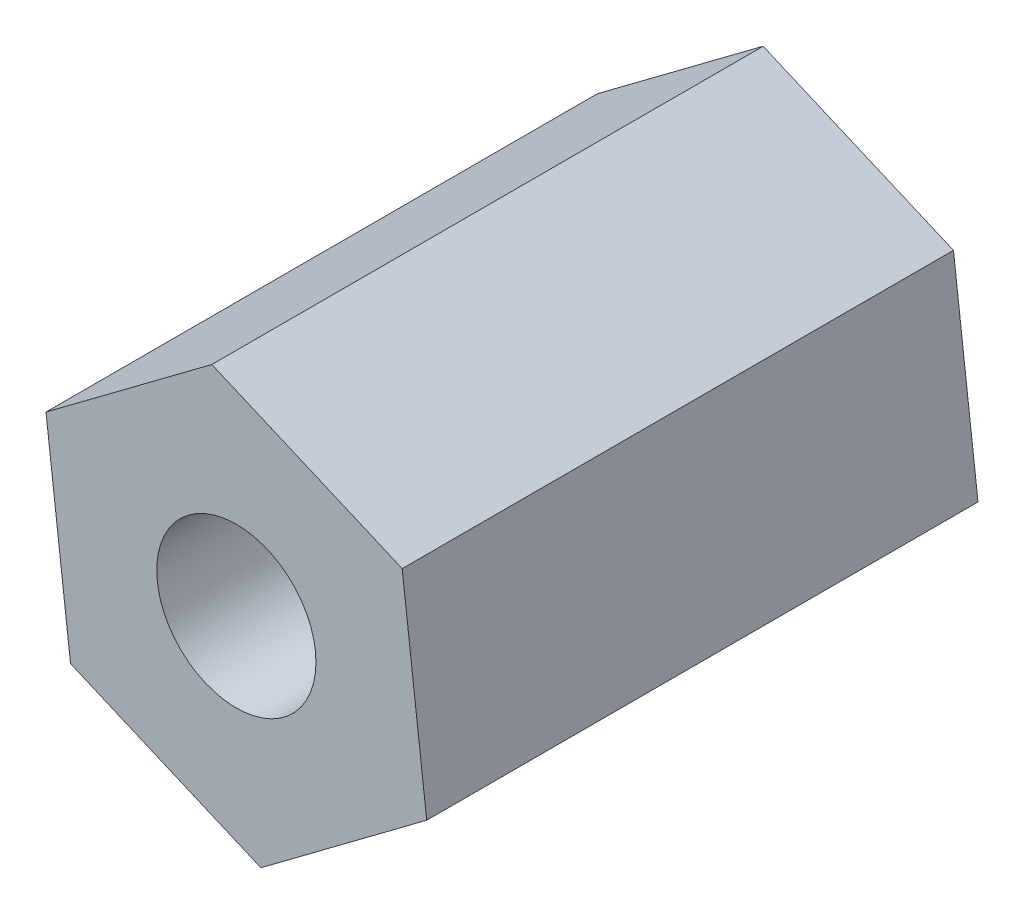
ISO-10303-21;
HEADER;
FILE_DESCRIPTION(('STEP AP214'),'2;1');
FILE_NAME('part.step','',(''),(''),'','','');
FILE_SCHEMA(('AUTOMOTIVE_DESIGN { 1 0 10303 214 1 1 1 1 }'));
ENDSEC;
DATA;
#1=APPLICATION_CONTEXT('core data for automotive mechanical design processes');
#2=APPLICATION_PROTOCOL_DEFINITION('international standard','automotive_design',2000,#1);
#3=PRODUCT_CONTEXT('',#1,'mechanical');
#4=PRODUCT('Part','Part','',(#3));
#5=PRODUCT_RELATED_PRODUCT_CATEGORY('part','',(#4));
#6=PRODUCT_DEFINITION_FORMATION('','',#4);
#7=PRODUCT_DEFINITION_CONTEXT('part definition',#1,'design');
#8=PRODUCT_DEFINITION('design','',#6,#7);
#9=PRODUCT_DEFINITION_SHAPE('','',#8);
#10=(LENGTH_UNIT() NAMED_UNIT(*) SI_UNIT(.MILLI.,.METRE.));
#11=(NAMED_UNIT(*) PLANE_ANGLE_UNIT() SI_UNIT($,.RADIAN.));
#12=(NAMED_UNIT(*) SI_UNIT($,.STERADIAN.) SOLID_ANGLE_UNIT());
#13=UNCERTAINTY_MEASURE_WITH_UNIT(LENGTH_MEASURE(1.E-05),#10,'distance_accuracy_value','');
#14=(GEOMETRIC_REPRESENTATION_CONTEXT(3) GLOBAL_UNCERTAINTY_ASSIGNED_CONTEXT((#13)) GLOBAL_UNIT_ASSIGNED_CONTEXT((#10,
#11,#12)) REPRESENTATION_CONTEXT('',''));
#15=CARTESIAN_POINT('',(0.,0.,0.));
#16=DIRECTION('',(0.,0.,1.));
#17=DIRECTION('',(1.,0.,0.));
#18=AXIS2_PLACEMENT_3D('',#15,#16,#17);
#19=CARTESIAN_POINT('',(-76.4397626249095,4.73853474268454,4.7498));
#20=DIRECTION('',(0.,0.,1.));
#21=DIRECTION('',(1.,0.,0.));
#22=AXIS2_PLACEMENT_3D('',#19,#20,#21);
#23=PLANE('',#22);
#24=DIRECTION('',(0.80071663461952,0.599043296468285,0.));
#25=VECTOR('',#24,1.);
#26=CARTESIAN_POINT('',(-79.2972800788762,2.60072893057818,4.7498));
#27=LINE('',#26,#25);
#28=CARTESIAN_POINT('',(-79.2972800788762,2.60072893057818,4.7498));
#29=VERTEX_POINT('',#28);
#30=CARTESIAN_POINT('',(-76.4397626249095,4.73853474268454,4.7498));
#31=VERTEX_POINT('',#30);
#32=EDGE_CURVE('E131',#29,#31,#27,.T.);
#33=ORIENTED_EDGE('',*,*,#32,.T.);
#34=DIRECTION('',(-0.118428395398547,0.992962595047429,0.));
#35=VECTOR('',#34,1.);
#36=CARTESIAN_POINT('',(-76.4397626249095,4.73853474268454,4.7498));
#37=LINE('',#36,#35);
#38=CARTESIAN_POINT('',(-76.8623980395683,8.28212035563032,4.7498));
#39=VERTEX_POINT('',#38);
#40=EDGE_CURVE('E89',#31,#39,#37,.T.);
#41=ORIENTED_EDGE('',*,*,#40,.T.);
#42=DIRECTION('',(-0.919145030018067,0.393919298579146,0.));
#43=VECTOR('',#42,1.);
#44=CARTESIAN_POINT('',(-76.8623980395683,8.28212035563032,4.7498));
#45=LINE('',#44,#43);
#46=CARTESIAN_POINT('',(-80.1425509081938,9.6879001564697,4.7498));
#47=VERTEX_POINT('',#46);
#48=EDGE_CURVE('E102',#39,#47,#45,.T.);
#49=ORIENTED_EDGE('',*,*,#48,.T.);
#50=DIRECTION('',(-0.800716634619521,-0.599043296468283,0.));
#51=VECTOR('',#50,1.);
#52=CARTESIAN_POINT('',(-80.1425509081938,9.6879001564697,4.7498));
#53=LINE('',#52,#51);
#54=CARTESIAN_POINT('',(-83.0000683621605,7.55009434436333,4.7498));
#55=VERTEX_POINT('',#54);
#56=EDGE_CURVE('E96',#47,#55,#53,.T.);
#57=ORIENTED_EDGE('',*,*,#56,.T.);
#58=DIRECTION('',(0.118428395398548,-0.992962595047429,0.));
#59=VECTOR('',#58,1.);
#60=CARTESIAN_POINT('',(-83.0000683621605,7.55009434436333,4.7498));
#61=LINE('',#60,#59);
#62=CARTESIAN_POINT('',(-82.5774329475017,4.00650873141756,4.7498));
#63=VERTEX_POINT('',#62);
#64=EDGE_CURVE('E100',#55,#63,#61,.T.);
#65=ORIENTED_EDGE('',*,*,#64,.T.);
#66=DIRECTION('',(0.919145030018067,-0.393919298579145,0.));
#67=VECTOR('',#66,1.);
#68=CARTESIAN_POINT('',(-82.5774329475017,4.00650873141756,4.7498));
#69=LINE('',#68,#67);
#70=EDGE_CURVE('E52',#63,#29,#69,.T.);
#71=ORIENTED_EDGE('',*,*,#70,.T.);
#72=EDGE_LOOP('',(#33,#41,#49,#57,#65,#71));
#73=FACE_BOUND('',#72,.T.);
#74=CARTESIAN_POINT('',(-79.719915493535,6.14431454352392,4.7498));
#75=DIRECTION('',(0.,0.,1.));
#76=DIRECTION('',(1.,0.,0.));
#77=AXIS2_PLACEMENT_3D('',#74,#75,#76);
#78=CIRCLE('',#77,1.3716);
#79=CARTESIAN_POINT('',(-78.348315493535,6.14431454352392,4.7498));
#80=VERTEX_POINT('',#79);
#81=EDGE_CURVE('E124',#80,#80,#78,.T.);
#82=ORIENTED_EDGE('',*,*,#81,.F.);
#83=EDGE_LOOP('',(#82));
#84=FACE_BOUND('',#83,.T.);
#85=ADVANCED_FACE('F35',(#73,#84),#23,.T.);
#86=CARTESIAN_POINT('',(-76.4397626249095,4.73853474268454,-4.7498));
#87=DIRECTION('',(0.,0.,1.));
#88=DIRECTION('',(1.,0.,0.));
#89=AXIS2_PLACEMENT_3D('',#86,#87,#88);
#90=PLANE('',#89);
#91=DIRECTION('',(0.80071663461952,0.599043296468285,0.));
#92=VECTOR('',#91,1.);
#93=CARTESIAN_POINT('',(-79.2972800788762,2.60072893057818,-4.7498));
#94=LINE('',#93,#92);
#95=CARTESIAN_POINT('',(-79.2972800788762,2.60072893057818,-4.7498));
#96=VERTEX_POINT('',#95);
#97=CARTESIAN_POINT('',(-76.4397626249095,4.73853474268454,-4.7498));
#98=VERTEX_POINT('',#97);
#99=EDGE_CURVE('E120',#96,#98,#94,.T.);
#100=ORIENTED_EDGE('',*,*,#99,.F.);
#101=DIRECTION('',(0.919145030018067,-0.393919298579145,0.));
#102=VECTOR('',#101,1.);
#103=CARTESIAN_POINT('',(-82.5774329475017,4.00650873141756,-4.7498));
#104=LINE('',#103,#102);
#105=CARTESIAN_POINT('',(-82.5774329475017,4.00650873141756,-4.7498));
#106=VERTEX_POINT('',#105);
#107=EDGE_CURVE('E81',#106,#96,#104,.T.);
#108=ORIENTED_EDGE('',*,*,#107,.F.);
#109=DIRECTION('',(0.118428395398548,-0.992962595047429,0.));
#110=VECTOR('',#109,1.);
#111=CARTESIAN_POINT('',(-83.0000683621605,7.55009434436333,-4.7498));
#112=LINE('',#111,#110);
#113=CARTESIAN_POINT('',(-83.0000683621605,7.55009434436333,-4.7498));
#114=VERTEX_POINT('',#113);
#115=EDGE_CURVE('E75',#114,#106,#112,.T.);
#116=ORIENTED_EDGE('',*,*,#115,.F.);
#117=DIRECTION('',(-0.800716634619521,-0.599043296468283,0.));
#118=VECTOR('',#117,1.);
#119=CARTESIAN_POINT('',(-80.1425509081938,9.6879001564697,-4.7498));
#120=LINE('',#119,#118);
#121=CARTESIAN_POINT('',(-80.1425509081938,9.6879001564697,-4.7498));
#122=VERTEX_POINT('',#121);
#123=EDGE_CURVE('E110',#122,#114,#120,.T.);
#124=ORIENTED_EDGE('',*,*,#123,.F.);
#125=DIRECTION('',(-0.919145030018067,0.393919298579146,0.));
#126=VECTOR('',#125,1.);
#127=CARTESIAN_POINT('',(-76.8623980395683,8.28212035563032,-4.7498));
#128=LINE('',#127,#126);
#129=CARTESIAN_POINT('',(-76.8623980395683,8.28212035563032,-4.7498));
#130=VERTEX_POINT('',#129);
#131=EDGE_CURVE('E126',#130,#122,#128,.T.);
#132=ORIENTED_EDGE('',*,*,#131,.F.);
#133=DIRECTION('',(-0.118428395398547,0.992962595047429,0.));
#134=VECTOR('',#133,1.);
#135=CARTESIAN_POINT('',(-76.4397626249095,4.73853474268454,-4.7498));
#136=LINE('',#135,#134);
#137=EDGE_CURVE('E123',#98,#130,#136,.T.);
#138=ORIENTED_EDGE('',*,*,#137,.F.);
#139=EDGE_LOOP('',(#100,#108,#116,#124,#132,#138));
#140=FACE_BOUND('',#139,.T.);
#141=CARTESIAN_POINT('',(-79.719915493535,6.14431454352392,-4.7498));
#142=DIRECTION('',(0.,0.,1.));
#143=DIRECTION('',(1.,0.,0.));
#144=AXIS2_PLACEMENT_3D('',#141,#142,#143);
#145=CIRCLE('',#144,1.3716);
#146=CARTESIAN_POINT('',(-78.348315493535,6.14431454352392,-4.7498));
#147=VERTEX_POINT('',#146);
#148=EDGE_CURVE('E224',#147,#147,#145,.T.);
#149=ORIENTED_EDGE('',*,*,#148,.T.);
#150=EDGE_LOOP('',(#149));
#151=FACE_BOUND('',#150,.T.);
#152=ADVANCED_FACE('F140',(#140,#151),#90,.F.);
#153=CARTESIAN_POINT('',(-79.2972800788762,2.60072893057818,4.7498));
#154=DIRECTION('',(-0.599043296468285,0.80071663461952,0.));
#155=DIRECTION('',(-0.80071663461952,-0.599043296468285,0.));
#156=AXIS2_PLACEMENT_3D('',#153,#154,#155);
#157=PLANE('',#156);
#158=ORIENTED_EDGE('',*,*,#99,.T.);
#159=DIRECTION('',(0.,0.,-1.));
#160=VECTOR('',#159,1.);
#161=CARTESIAN_POINT('',(-76.4397626249095,4.73853474268454,4.7498));
#162=LINE('',#161,#160);
#163=EDGE_CURVE('E11',#31,#98,#162,.T.);
#164=ORIENTED_EDGE('',*,*,#163,.F.);
#165=ORIENTED_EDGE('',*,*,#32,.F.);
#166=DIRECTION('',(0.,0.,-1.));
#167=VECTOR('',#166,1.);
#168=CARTESIAN_POINT('',(-79.2972800788762,2.60072893057818,4.7498));
#169=LINE('',#168,#167);
#170=EDGE_CURVE('E116',#29,#96,#169,.T.);
#171=ORIENTED_EDGE('',*,*,#170,.T.);
#172=EDGE_LOOP('',(#158,#164,#165,#171));
#173=FACE_BOUND('',#172,.T.);
#174=ADVANCED_FACE('F37',(#173),#157,.F.);
#175=CARTESIAN_POINT('',(-76.4397626249095,4.73853474268454,4.7498));
#176=DIRECTION('',(-0.992962595047429,-0.118428395398547,0.));
#177=DIRECTION('',(0.118428395398547,-0.992962595047429,0.));
#178=AXIS2_PLACEMENT_3D('',#175,#176,#177);
#179=PLANE('',#178);
#180=ORIENTED_EDGE('',*,*,#137,.T.);
#181=DIRECTION('',(0.,0.,-1.));
#182=VECTOR('',#181,1.);
#183=CARTESIAN_POINT('',(-76.8623980395683,8.28212035563032,4.7498));
#184=LINE('',#183,#182);
#185=EDGE_CURVE('E44',#39,#130,#184,.T.);
#186=ORIENTED_EDGE('',*,*,#185,.F.);
#187=ORIENTED_EDGE('',*,*,#40,.F.);
#188=ORIENTED_EDGE('',*,*,#163,.T.);
#189=EDGE_LOOP('',(#180,#186,#187,#188));
#190=FACE_BOUND('',#189,.T.);
#191=ADVANCED_FACE('F165',(#190),#179,.F.);
#192=CARTESIAN_POINT('',(-76.8623980395683,8.28212035563032,4.7498));
#193=DIRECTION('',(-0.393919298579146,-0.919145030018067,0.));
#194=DIRECTION('',(0.919145030018067,-0.393919298579146,0.));
#195=AXIS2_PLACEMENT_3D('',#192,#193,#194);
#196=PLANE('',#195);
#197=ORIENTED_EDGE('',*,*,#131,.T.);
#198=DIRECTION('',(0.,0.,-1.));
#199=VECTOR('',#198,1.);
#200=CARTESIAN_POINT('',(-80.1425509081938,9.6879001564697,4.7498));
#201=LINE('',#200,#199);
#202=EDGE_CURVE('E111',#47,#122,#201,.T.);
#203=ORIENTED_EDGE('',*,*,#202,.F.);
#204=ORIENTED_EDGE('',*,*,#48,.F.);
#205=ORIENTED_EDGE('',*,*,#185,.T.);
#206=EDGE_LOOP('',(#197,#203,#204,#205));
#207=FACE_BOUND('',#206,.T.);
#208=ADVANCED_FACE('F137',(#207),#196,.F.);
#209=CARTESIAN_POINT('',(-80.1425509081938,9.6879001564697,4.7498));
#210=DIRECTION('',(0.599043296468283,-0.800716634619521,0.));
#211=DIRECTION('',(0.800716634619521,0.599043296468283,0.));
#212=AXIS2_PLACEMENT_3D('',#209,#210,#211);
#213=PLANE('',#212);
#214=ORIENTED_EDGE('',*,*,#123,.T.);
#215=DIRECTION('',(0.,0.,-1.));
#216=VECTOR('',#215,1.);
#217=CARTESIAN_POINT('',(-83.0000683621605,7.55009434436333,4.7498));
#218=LINE('',#217,#216);
#219=EDGE_CURVE('E107',#55,#114,#218,.T.);
#220=ORIENTED_EDGE('',*,*,#219,.F.);
#221=ORIENTED_EDGE('',*,*,#56,.F.);
#222=ORIENTED_EDGE('',*,*,#202,.T.);
#223=EDGE_LOOP('',(#214,#220,#221,#222));
#224=FACE_BOUND('',#223,.T.);
#225=ADVANCED_FACE('F108',(#224),#213,.F.);
#226=CARTESIAN_POINT('',(-83.0000683621605,7.55009434436333,4.7498));
#227=DIRECTION('',(0.992962595047429,0.118428395398548,0.));
#228=DIRECTION('',(-0.118428395398548,0.99296259504743,0.));
#229=AXIS2_PLACEMENT_3D('',#226,#227,#228);
#230=PLANE('',#229);
#231=ORIENTED_EDGE('',*,*,#115,.T.);
#232=DIRECTION('',(0.,0.,-1.));
#233=VECTOR('',#232,1.);
#234=CARTESIAN_POINT('',(-82.5774329475017,4.00650873141756,4.7498));
#235=LINE('',#234,#233);
#236=EDGE_CURVE('E112',#63,#106,#235,.T.);
#237=ORIENTED_EDGE('',*,*,#236,.F.);
#238=ORIENTED_EDGE('',*,*,#64,.F.);
#239=ORIENTED_EDGE('',*,*,#219,.T.);
#240=EDGE_LOOP('',(#231,#237,#238,#239));
#241=FACE_BOUND('',#240,.T.);
#242=ADVANCED_FACE('F114',(#241),#230,.F.);
#243=CARTESIAN_POINT('',(-82.5774329475017,4.00650873141756,4.7498));
#244=DIRECTION('',(0.393919298579145,0.919145030018067,0.));
#245=DIRECTION('',(-0.919145030018068,0.393919298579145,0.));
#246=AXIS2_PLACEMENT_3D('',#243,#244,#245);
#247=PLANE('',#246);
#248=ORIENTED_EDGE('',*,*,#107,.T.);
#249=ORIENTED_EDGE('',*,*,#170,.F.);
#250=ORIENTED_EDGE('',*,*,#70,.F.);
#251=ORIENTED_EDGE('',*,*,#236,.T.);
#252=EDGE_LOOP('',(#248,#249,#250,#251));
#253=FACE_BOUND('',#252,.T.);
#254=ADVANCED_FACE('F145',(#253),#247,.F.);
#255=CARTESIAN_POINT('',(-79.719915493535,6.14431454352392,4.7498));
#256=DIRECTION('',(0.,0.,-1.));
#257=DIRECTION('',(-1.,0.,0.));
#258=AXIS2_PLACEMENT_3D('',#255,#256,#257);
#259=CYLINDRICAL_SURFACE('',#258,1.3716);
#260=ORIENTED_EDGE('',*,*,#81,.T.);
#261=EDGE_LOOP('',(#260));
#262=FACE_BOUND('',#261,.T.);
#263=ORIENTED_EDGE('',*,*,#148,.F.);
#264=EDGE_LOOP('',(#263));
#265=FACE_BOUND('',#264,.T.);
#266=ADVANCED_FACE('F147',(#262,#265),#259,.F.);
#267=CLOSED_SHELL('',(#85,#152,#174,#191,#208,#225,#242,#254,#266));
#268=MANIFOLD_SOLID_BREP('B2',#267);
#269=ADVANCED_BREP_SHAPE_REPRESENTATION('',(#18,#268),#14);
#270=SHAPE_DEFINITION_REPRESENTATION(#9,#269);
ENDSEC;
END-ISO-10303-21;
